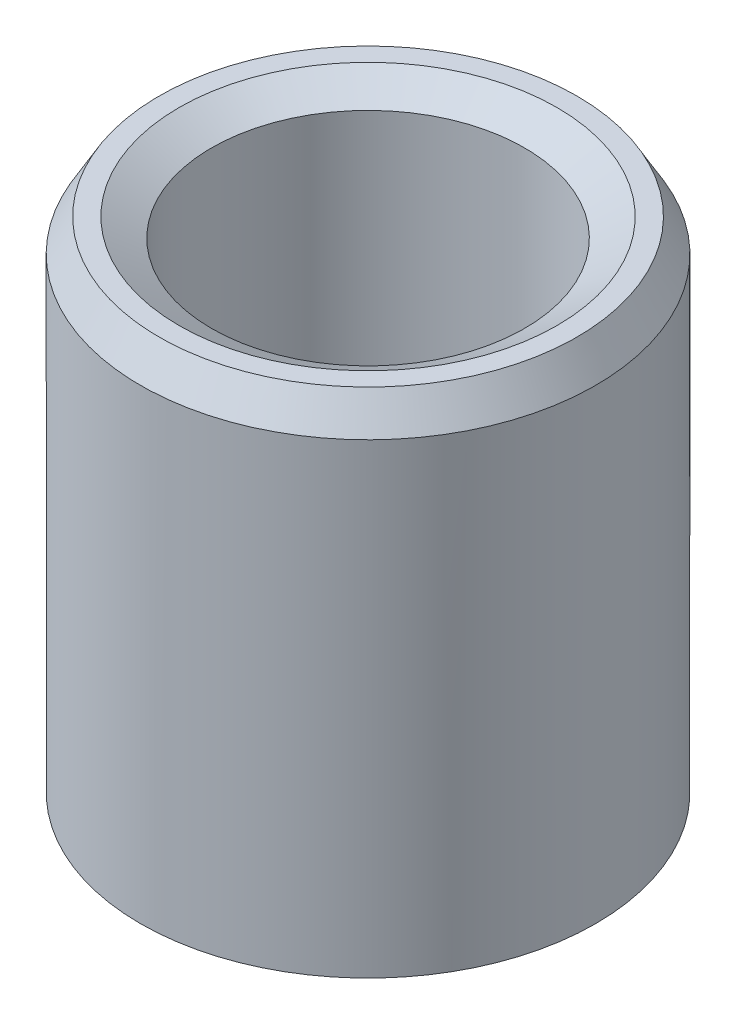
ISO-10303-21;
HEADER;
FILE_DESCRIPTION(('STEP AP214'),'2;1');
FILE_NAME('part.step','',(''),(''),'','','');
FILE_SCHEMA(('AUTOMOTIVE_DESIGN { 1 0 10303 214 1 1 1 1 }'));
ENDSEC;
DATA;
#1=APPLICATION_CONTEXT('core data for automotive mechanical design processes');
#2=APPLICATION_PROTOCOL_DEFINITION('international standard','automotive_design',2000,#1);
#3=PRODUCT_CONTEXT('',#1,'mechanical');
#4=PRODUCT('Part','Part','',(#3));
#5=PRODUCT_RELATED_PRODUCT_CATEGORY('part','',(#4));
#6=PRODUCT_DEFINITION_FORMATION('','',#4);
#7=PRODUCT_DEFINITION_CONTEXT('part definition',#1,'design');
#8=PRODUCT_DEFINITION('design','',#6,#7);
#9=PRODUCT_DEFINITION_SHAPE('','',#8);
#10=(LENGTH_UNIT() NAMED_UNIT(*) SI_UNIT(.MILLI.,.METRE.));
#11=(NAMED_UNIT(*) PLANE_ANGLE_UNIT() SI_UNIT($,.RADIAN.));
#12=(NAMED_UNIT(*) SI_UNIT($,.STERADIAN.) SOLID_ANGLE_UNIT());
#13=UNCERTAINTY_MEASURE_WITH_UNIT(LENGTH_MEASURE(1.E-05),#10,'distance_accuracy_value','');
#14=(GEOMETRIC_REPRESENTATION_CONTEXT(3) GLOBAL_UNCERTAINTY_ASSIGNED_CONTEXT((#13)) GLOBAL_UNIT_ASSIGNED_CONTEXT((#10,
#11,#12)) REPRESENTATION_CONTEXT('',''));
#15=CARTESIAN_POINT('',(0.,0.,0.));
#16=DIRECTION('',(0.,0.,1.));
#17=DIRECTION('',(1.,0.,0.));
#18=AXIS2_PLACEMENT_3D('',#15,#16,#17);
#19=CARTESIAN_POINT('',(0.,45.4611297409738,0.));
#20=DIRECTION('',(0.,-1.,0.));
#21=DIRECTION('',(0.,0.,-1.));
#22=AXIS2_PLACEMENT_3D('',#19,#20,#21);
#23=CYLINDRICAL_SURFACE('',#22,20.);
#24=CARTESIAN_POINT('',(0.,1.64509186786798,0.));
#25=DIRECTION('',(0.,1.,0.));
#26=DIRECTION('',(0.,0.,1.));
#27=AXIS2_PLACEMENT_3D('',#24,#25,#26);
#28=CIRCLE('',#27,20.);
#29=CARTESIAN_POINT('',(0.,1.64509186786798,20.));
#30=VERTEX_POINT('',#29);
#31=EDGE_CURVE('E10',#30,#30,#28,.T.);
#32=ORIENTED_EDGE('',*,*,#31,.T.);
#33=EDGE_LOOP('',(#32));
#34=FACE_BOUND('',#33,.T.);
#35=CARTESIAN_POINT('',(0.,42.6117470427081,0.));
#36=DIRECTION('',(0.,1.,0.));
#37=DIRECTION('',(0.,0.,1.));
#38=AXIS2_PLACEMENT_3D('',#35,#36,#37);
#39=CIRCLE('',#38,20.);
#40=CARTESIAN_POINT('',(0.,42.6117470427081,-20.));
#41=VERTEX_POINT('',#40);
#42=EDGE_CURVE('E50',#41,#41,#39,.F.);
#43=ORIENTED_EDGE('',*,*,#42,.T.);
#44=EDGE_LOOP('',(#43));
#45=FACE_BOUND('',#44,.T.);
#46=ADVANCED_FACE('F39',(#34,#45),#23,.T.);
#47=CARTESIAN_POINT('',(0.,45.4611297409738,0.));
#48=DIRECTION('',(0.,1.,0.));
#49=DIRECTION('',(0.,0.,1.));
#50=AXIS2_PLACEMENT_3D('',#47,#48,#49);
#51=PLANE('',#50);
#52=CARTESIAN_POINT('',(0.,45.4611297409738,0.));
#53=DIRECTION('',(0.,1.,0.));
#54=DIRECTION('',(0.,0.,1.));
#55=AXIS2_PLACEMENT_3D('',#52,#53,#54);
#56=CIRCLE('',#55,16.6012108902607);
#57=CARTESIAN_POINT('',(0.,45.4611297409738,16.6012108902607));
#58=VERTEX_POINT('',#57);
#59=EDGE_CURVE('E58',#58,#58,#56,.F.);
#60=ORIENTED_EDGE('',*,*,#59,.T.);
#61=EDGE_LOOP('',(#60));
#62=FACE_BOUND('',#61,.T.);
#63=CARTESIAN_POINT('',(0.,45.4611297409738,0.));
#64=DIRECTION('',(0.,1.,0.));
#65=DIRECTION('',(0.,0.,1.));
#66=AXIS2_PLACEMENT_3D('',#63,#64,#65);
#67=CIRCLE('',#66,18.354908132132);
#68=CARTESIAN_POINT('',(0.,45.4611297409738,-18.354908132132));
#69=VERTEX_POINT('',#68);
#70=EDGE_CURVE('E61',#69,#69,#67,.T.);
#71=ORIENTED_EDGE('',*,*,#70,.T.);
#72=EDGE_LOOP('',(#71));
#73=FACE_BOUND('',#72,.T.);
#74=ADVANCED_FACE('F88',(#62,#73),#51,.T.);
#75=CARTESIAN_POINT('',(0.,0.,0.));
#76=DIRECTION('',(0.,1.,0.));
#77=DIRECTION('',(0.,0.,1.));
#78=AXIS2_PLACEMENT_3D('',#75,#76,#77);
#79=PLANE('',#78);
#80=CARTESIAN_POINT('',(0.,0.,0.));
#81=DIRECTION('',(0.,1.,0.));
#82=DIRECTION('',(0.,0.,1.));
#83=AXIS2_PLACEMENT_3D('',#80,#81,#82);
#84=CIRCLE('',#83,15.3969200598629);
#85=CARTESIAN_POINT('',(0.,0.,15.3969200598629));
#86=VERTEX_POINT('',#85);
#87=EDGE_CURVE('E51',#86,#86,#84,.T.);
#88=ORIENTED_EDGE('',*,*,#87,.T.);
#89=EDGE_LOOP('',(#88));
#90=FACE_BOUND('',#89,.T.);
#91=CARTESIAN_POINT('',(0.,0.,0.));
#92=DIRECTION('',(0.,1.,0.));
#93=DIRECTION('',(0.,0.,1.));
#94=AXIS2_PLACEMENT_3D('',#91,#92,#93);
#95=CIRCLE('',#94,17.1506173017343);
#96=CARTESIAN_POINT('',(0.,0.,17.1506173017343));
#97=VERTEX_POINT('',#96);
#98=EDGE_CURVE('E54',#97,#97,#95,.F.);
#99=ORIENTED_EDGE('',*,*,#98,.T.);
#100=EDGE_LOOP('',(#99));
#101=FACE_BOUND('',#100,.T.);
#102=ADVANCED_FACE('F83',(#90,#101),#79,.F.);
#103=CARTESIAN_POINT('',(0.,45.4611297409738,0.));
#104=DIRECTION('',(0.,-1.,0.));
#105=DIRECTION('',(0.,0.,-1.));
#106=AXIS2_PLACEMENT_3D('',#103,#104,#105);
#107=CYLINDRICAL_SURFACE('',#106,13.7518281919949);
#108=CARTESIAN_POINT('',(0.,43.8160378731058,0.));
#109=DIRECTION('',(0.,1.,0.));
#110=DIRECTION('',(0.,0.,1.));
#111=AXIS2_PLACEMENT_3D('',#108,#109,#110);
#112=CIRCLE('',#111,13.7518281919949);
#113=CARTESIAN_POINT('',(0.,43.8160378731058,13.7518281919949));
#114=VERTEX_POINT('',#113);
#115=EDGE_CURVE('E67',#114,#114,#112,.T.);
#116=ORIENTED_EDGE('',*,*,#115,.T.);
#117=EDGE_LOOP('',(#116));
#118=FACE_BOUND('',#117,.T.);
#119=CARTESIAN_POINT('',(0.,2.84938269826575,0.));
#120=DIRECTION('',(0.,1.,0.));
#121=DIRECTION('',(0.,0.,1.));
#122=AXIS2_PLACEMENT_3D('',#119,#120,#121);
#123=CIRCLE('',#122,13.7518281919949);
#124=CARTESIAN_POINT('',(0.,2.84938269826575,13.7518281919949));
#125=VERTEX_POINT('',#124);
#126=EDGE_CURVE('E69',#125,#125,#123,.F.);
#127=ORIENTED_EDGE('',*,*,#126,.T.);
#128=EDGE_LOOP('',(#127));
#129=FACE_BOUND('',#128,.T.);
#130=ADVANCED_FACE('F71',(#118,#129),#107,.F.);
#131=CARTESIAN_POINT('',(0.,43.8160378731058,0.));
#132=DIRECTION('',(0.,1.,0.));
#133=DIRECTION('',(0.,0.,1.));
#134=AXIS2_PLACEMENT_3D('',#131,#132,#133);
#135=CONICAL_SURFACE('',#134,13.7518281919949,1.0471975511966);
#136=ORIENTED_EDGE('',*,*,#59,.F.);
#137=EDGE_LOOP('',(#136));
#138=FACE_BOUND('',#137,.T.);
#139=ORIENTED_EDGE('',*,*,#115,.F.);
#140=EDGE_LOOP('',(#139));
#141=FACE_BOUND('',#140,.T.);
#142=ADVANCED_FACE('F77',(#138,#141),#135,.F.);
#143=CARTESIAN_POINT('',(0.,0.,0.));
#144=DIRECTION('',(0.,-1.,0.));
#145=DIRECTION('',(0.,0.,-1.));
#146=AXIS2_PLACEMENT_3D('',#143,#144,#145);
#147=CONICAL_SURFACE('',#146,15.3969200598629,0.523598775598297);
#148=ORIENTED_EDGE('',*,*,#126,.F.);
#149=EDGE_LOOP('',(#148));
#150=FACE_BOUND('',#149,.T.);
#151=ORIENTED_EDGE('',*,*,#87,.F.);
#152=EDGE_LOOP('',(#151));
#153=FACE_BOUND('',#152,.T.);
#154=ADVANCED_FACE('F73',(#150,#153),#147,.F.);
#155=CARTESIAN_POINT('',(0.,1.64509186786798,0.));
#156=DIRECTION('',(0.,1.,0.));
#157=DIRECTION('',(0.,0.,1.));
#158=AXIS2_PLACEMENT_3D('',#155,#156,#157);
#159=CONICAL_SURFACE('',#158,20.,1.0471975511966);
#160=ORIENTED_EDGE('',*,*,#98,.F.);
#161=EDGE_LOOP('',(#160));
#162=FACE_BOUND('',#161,.T.);
#163=ORIENTED_EDGE('',*,*,#31,.F.);
#164=EDGE_LOOP('',(#163));
#165=FACE_BOUND('',#164,.T.);
#166=ADVANCED_FACE('F76',(#162,#165),#159,.T.);
#167=CARTESIAN_POINT('',(0.,45.4611297409738,0.));
#168=DIRECTION('',(0.,-1.,0.));
#169=DIRECTION('',(0.,0.,-1.));
#170=AXIS2_PLACEMENT_3D('',#167,#168,#169);
#171=CONICAL_SURFACE('',#170,18.354908132132,0.523598775598296);
#172=CARTESIAN_POINT('',(0.,42.6117470427081,-20.));
#173=CARTESIAN_POINT('',(0.,42.6414281124817,-19.9828636263764));
#174=CARTESIAN_POINT('',(0.,42.6711091822553,-19.9657272527528));
#175=CARTESIAN_POINT('',(0.,42.7304713218025,-19.9314545055055));
#176=CARTESIAN_POINT('',(0.,42.7601523915761,-19.9143181318819));
#177=CARTESIAN_POINT('',(0.,42.8195145311233,-19.8800453846346));
#178=CARTESIAN_POINT('',(0.,42.8491956008969,-19.862909011011));
#179=CARTESIAN_POINT('',(0.,42.9085577404441,-19.8286362637638));
#180=CARTESIAN_POINT('',(0.,42.9382388102177,-19.8114998901401));
#181=CARTESIAN_POINT('',(0.,42.9976009497649,-19.7772271428929));
#182=CARTESIAN_POINT('',(0.,43.0272820195385,-19.7600907692693));
#183=CARTESIAN_POINT('',(0.,43.0866441590857,-19.725818022022));
#184=CARTESIAN_POINT('',(0.,43.1163252288593,-19.7086816483984));
#185=CARTESIAN_POINT('',(0.,43.1756873684065,-19.6744089011511));
#186=CARTESIAN_POINT('',(0.,43.2053684381801,-19.6572725275275));
#187=CARTESIAN_POINT('',(0.,43.2647305777273,-19.6229997802803));
#188=CARTESIAN_POINT('',(0.,43.2944116475009,-19.6058634066566));
#189=CARTESIAN_POINT('',(0.,43.3537737870481,-19.5715906594094));
#190=CARTESIAN_POINT('',(0.,43.3834548568217,-19.5544542857858));
#191=CARTESIAN_POINT('',(0.,43.4428169963689,-19.5201815385385));
#192=CARTESIAN_POINT('',(0.,43.4724980661425,-19.5030451649149));
#193=CARTESIAN_POINT('',(0.,43.5318602056897,-19.4687724176676));
#194=CARTESIAN_POINT('',(0.,43.5615412754633,-19.451636044044));
#195=CARTESIAN_POINT('',(0.,43.6209034150105,-19.4173632967968));
#196=CARTESIAN_POINT('',(0.,43.6505844847841,-19.4002269231731));
#197=CARTESIAN_POINT('',(0.,43.7099466243313,-19.3659541759259));
#198=CARTESIAN_POINT('',(0.,43.7396276941049,-19.3488178023023));
#199=CARTESIAN_POINT('',(0.,43.7989898336521,-19.314545055055));
#200=CARTESIAN_POINT('',(0.,43.8286709034257,-19.2974086814314));
#201=CARTESIAN_POINT('',(0.,43.8880330429729,-19.2631359341841));
#202=CARTESIAN_POINT('',(0.,43.9177141127465,-19.2459995605605));
#203=CARTESIAN_POINT('',(0.,43.9770762522937,-19.2117268133133));
#204=CARTESIAN_POINT('',(0.,44.0067573220673,-19.1945904396896));
#205=CARTESIAN_POINT('',(0.,44.0661194616145,-19.1603176924424));
#206=CARTESIAN_POINT('',(0.,44.0958005313881,-19.1431813188188));
#207=CARTESIAN_POINT('',(0.,44.1551626709353,-19.1089085715715));
#208=CARTESIAN_POINT('',(0.,44.1848437407089,-19.0917721979479));
#209=CARTESIAN_POINT('',(0.,44.2442058802561,-19.0574994507006));
#210=CARTESIAN_POINT('',(0.,44.2738869500298,-19.040363077077));
#211=CARTESIAN_POINT('',(0.,44.333249089577,-19.0060903298298));
#212=CARTESIAN_POINT('',(0.,44.3629301593506,-18.9889539562061));
#213=CARTESIAN_POINT('',(0.,44.4222922988978,-18.9546812089589));
#214=CARTESIAN_POINT('',(0.,44.4519733686714,-18.9375448353353));
#215=CARTESIAN_POINT('',(0.,44.5113355082186,-18.903272088088));
#216=CARTESIAN_POINT('',(0.,44.5410165779922,-18.8861357144644));
#217=CARTESIAN_POINT('',(0.,44.6003787175394,-18.8518629672171));
#218=CARTESIAN_POINT('',(0.,44.630059787313,-18.8347265935935));
#219=CARTESIAN_POINT('',(0.,44.6894219268602,-18.8004538463463));
#220=CARTESIAN_POINT('',(0.,44.7191029966338,-18.7833174727226));
#221=CARTESIAN_POINT('',(0.,44.778465136181,-18.7490447254754));
#222=CARTESIAN_POINT('',(0.,44.8081462059546,-18.7319083518518));
#223=CARTESIAN_POINT('',(0.,44.8675083455018,-18.6976356046045));
#224=CARTESIAN_POINT('',(0.,44.8971894152754,-18.6804992309809));
#225=CARTESIAN_POINT('',(0.,44.9565515548226,-18.6462264837336));
#226=CARTESIAN_POINT('',(0.,44.9862326245962,-18.62909011011));
#227=CARTESIAN_POINT('',(0.,45.0455947641434,-18.5948173628628));
#228=CARTESIAN_POINT('',(0.,45.075275833917,-18.5776809892391));
#229=CARTESIAN_POINT('',(0.,45.1346379734642,-18.5434082419919));
#230=CARTESIAN_POINT('',(0.,45.1643190432378,-18.5262718683683));
#231=CARTESIAN_POINT('',(0.,45.223681182785,-18.491999121121));
#232=CARTESIAN_POINT('',(0.,45.2533622525586,-18.4748627474974));
#233=CARTESIAN_POINT('',(0.,45.3127243921058,-18.4405900002501));
#234=CARTESIAN_POINT('',(0.,45.3424054618794,-18.4234536266265));
#235=CARTESIAN_POINT('',(0.,45.4017676014266,-18.3891808793793));
#236=CARTESIAN_POINT('',(0.,45.4314486712002,-18.3720445057556));
#237=CARTESIAN_POINT('',(0.,45.4611297409738,-18.354908132132));
#238=B_SPLINE_CURVE_WITH_KNOTS('',3,(#172,#173,#174,#175,#176,#177,#178,#179,#180,#181,#182,
#183,#184,#185,#186,#187,#188,#189,#190,#191,#192,#193,#194,#195,#196,#197,#198,#199,#200,#201,
#202,#203,#204,#205,#206,#207,#208,#209,#210,#211,#212,#213,#214,#215,#216,#217,#218,#219,#220,
#221,#222,#223,#224,#225,#226,#227,#228,#229,#230,#231,#232,#233,#234,#235,#236,#237),
.UNSPECIFIED.,.F.,.F.,(4,2,2,2,2,2,2,2,2,2,2,2,2,2,2,2,2,2,2,2,2,2,2,2,2,2,2,2,2,2,2,2,4),(0.,
0.102818241741752,0.205636483483504,0.30845472522525,0.411272966967002,0.514091208708748,
0.6169094504505,0.719727692192252,0.822545933933998,0.92536417567575,1.0281824174175,
1.13100065915925,1.233818900901,1.33663714264275,1.4394553843845,1.54227362612624,
1.645091867868,1.74791010960975,1.85072835135149,1.95354659309325,2.05636483483499,
2.15918307657674,2.2620013183185,2.36481956006024,2.467637801802,2.57045604354374,
2.67327428528549,2.77609252702725,2.87891076876899,2.98172901051074,3.08454725225249,
3.18736549399424,3.29018373573599),.UNSPECIFIED.);
#239=EDGE_CURVE('BSEAM45',#41,#69,#238,.T.);
#240=ORIENTED_EDGE('',*,*,#42,.F.);
#241=ORIENTED_EDGE('',*,*,#70,.F.);
#242=ORIENTED_EDGE('',*,*,#239,.T.);
#243=ORIENTED_EDGE('',*,*,#239,.F.);
#244=EDGE_LOOP('',(#240,#242,#241,#243));
#245=FACE_BOUND('',#244,.T.);
#246=ADVANCED_FACE('F45',(#245),#171,.T.);
#247=CLOSED_SHELL('',(#46,#74,#102,#130,#142,#154,#166,#246));
#248=MANIFOLD_SOLID_BREP('B2',#247);
#249=ADVANCED_BREP_SHAPE_REPRESENTATION('',(#18,#248),#14);
#250=SHAPE_DEFINITION_REPRESENTATION(#9,#249);
ENDSEC;
END-ISO-10303-21;
